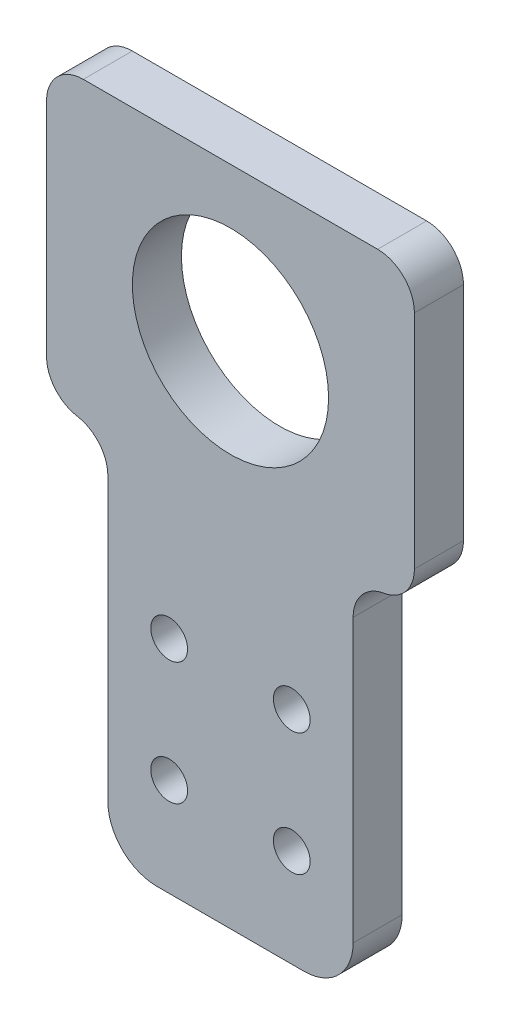
ISO-10303-21;
HEADER;
FILE_DESCRIPTION(('STEP AP214'),'2;1');
FILE_NAME('part.step','',(''),(''),'','','');
FILE_SCHEMA(('AUTOMOTIVE_DESIGN { 1 0 10303 214 1 1 1 1 }'));
ENDSEC;
DATA;
#1=APPLICATION_CONTEXT('core data for automotive mechanical design processes');
#2=APPLICATION_PROTOCOL_DEFINITION('international standard','automotive_design',2000,#1);
#3=PRODUCT_CONTEXT('',#1,'mechanical');
#4=PRODUCT('Part','Part','',(#3));
#5=PRODUCT_RELATED_PRODUCT_CATEGORY('part','',(#4));
#6=PRODUCT_DEFINITION_FORMATION('','',#4);
#7=PRODUCT_DEFINITION_CONTEXT('part definition',#1,'design');
#8=PRODUCT_DEFINITION('design','',#6,#7);
#9=PRODUCT_DEFINITION_SHAPE('','',#8);
#10=(LENGTH_UNIT() NAMED_UNIT(*) SI_UNIT(.MILLI.,.METRE.));
#11=(NAMED_UNIT(*) PLANE_ANGLE_UNIT() SI_UNIT($,.RADIAN.));
#12=(NAMED_UNIT(*) SI_UNIT($,.STERADIAN.) SOLID_ANGLE_UNIT());
#13=UNCERTAINTY_MEASURE_WITH_UNIT(LENGTH_MEASURE(1.E-05),#10,'distance_accuracy_value','');
#14=(GEOMETRIC_REPRESENTATION_CONTEXT(3) GLOBAL_UNCERTAINTY_ASSIGNED_CONTEXT((#13)) GLOBAL_UNIT_ASSIGNED_CONTEXT((#10,
#11,#12)) REPRESENTATION_CONTEXT('',''));
#15=CARTESIAN_POINT('',(0.,0.,0.));
#16=DIRECTION('',(0.,0.,1.));
#17=DIRECTION('',(1.,0.,0.));
#18=AXIS2_PLACEMENT_3D('',#15,#16,#17);
#19=CARTESIAN_POINT('',(6.,-11.,4.));
#20=DIRECTION('',(0.,0.,1.));
#21=DIRECTION('',(1.,0.,0.));
#22=AXIS2_PLACEMENT_3D('',#19,#20,#21);
#23=CYLINDRICAL_SURFACE('',#22,4.);
#24=DIRECTION('',(0.,0.,1.));
#25=VECTOR('',#24,1.);
#26=CARTESIAN_POINT('',(6.,-15.,4.));
#27=LINE('',#26,#25);
#28=CARTESIAN_POINT('',(6.,-15.,0.));
#29=VERTEX_POINT('',#28);
#30=CARTESIAN_POINT('',(6.,-15.,4.));
#31=VERTEX_POINT('',#30);
#32=EDGE_CURVE('E221',#29,#31,#27,.T.);
#33=ORIENTED_EDGE('',*,*,#32,.F.);
#34=CARTESIAN_POINT('',(6.,-11.,0.));
#35=DIRECTION('',(0.,0.,-1.));
#36=DIRECTION('',(-1.,0.,0.));
#37=AXIS2_PLACEMENT_3D('',#34,#35,#36);
#38=CIRCLE('',#37,4.);
#39=CARTESIAN_POINT('',(10.,-11.,0.));
#40=VERTEX_POINT('',#39);
#41=EDGE_CURVE('E40',#40,#29,#38,.T.);
#42=ORIENTED_EDGE('',*,*,#41,.F.);
#43=DIRECTION('',(0.,0.,1.));
#44=VECTOR('',#43,1.);
#45=CARTESIAN_POINT('',(10.,-11.,4.));
#46=LINE('',#45,#44);
#47=CARTESIAN_POINT('',(10.,-11.,4.));
#48=VERTEX_POINT('',#47);
#49=EDGE_CURVE('E137',#48,#40,#46,.F.);
#50=ORIENTED_EDGE('',*,*,#49,.F.);
#51=CARTESIAN_POINT('',(6.,-11.,4.));
#52=DIRECTION('',(0.,0.,-1.));
#53=DIRECTION('',(-1.,0.,0.));
#54=AXIS2_PLACEMENT_3D('',#51,#52,#53);
#55=CIRCLE('',#54,4.);
#56=EDGE_CURVE('E11',#31,#48,#55,.F.);
#57=ORIENTED_EDGE('',*,*,#56,.F.);
#58=EDGE_LOOP('',(#33,#42,#50,#57));
#59=FACE_BOUND('',#58,.T.);
#60=ADVANCED_FACE('F33',(#59),#23,.T.);
#61=CARTESIAN_POINT('',(-6.,-11.,4.));
#62=DIRECTION('',(0.,0.,1.));
#63=DIRECTION('',(1.,0.,0.));
#64=AXIS2_PLACEMENT_3D('',#61,#62,#63);
#65=CYLINDRICAL_SURFACE('',#64,4.);
#66=DIRECTION('',(0.,0.,1.));
#67=VECTOR('',#66,1.);
#68=CARTESIAN_POINT('',(-10.,-11.,4.));
#69=LINE('',#68,#67);
#70=CARTESIAN_POINT('',(-10.,-11.,0.));
#71=VERTEX_POINT('',#70);
#72=CARTESIAN_POINT('',(-10.,-11.,4.));
#73=VERTEX_POINT('',#72);
#74=EDGE_CURVE('E211',#71,#73,#69,.T.);
#75=ORIENTED_EDGE('',*,*,#74,.F.);
#76=CARTESIAN_POINT('',(-6.,-11.,0.));
#77=DIRECTION('',(0.,0.,-1.));
#78=DIRECTION('',(-1.,0.,0.));
#79=AXIS2_PLACEMENT_3D('',#76,#77,#78);
#80=CIRCLE('',#79,4.);
#81=CARTESIAN_POINT('',(-6.,-15.,0.));
#82=VERTEX_POINT('',#81);
#83=EDGE_CURVE('E217',#82,#71,#80,.T.);
#84=ORIENTED_EDGE('',*,*,#83,.F.);
#85=DIRECTION('',(0.,0.,1.));
#86=VECTOR('',#85,1.);
#87=CARTESIAN_POINT('',(-6.,-15.,4.));
#88=LINE('',#87,#86);
#89=CARTESIAN_POINT('',(-6.,-15.,4.));
#90=VERTEX_POINT('',#89);
#91=EDGE_CURVE('E214',#90,#82,#88,.F.);
#92=ORIENTED_EDGE('',*,*,#91,.F.);
#93=CARTESIAN_POINT('',(-6.,-11.,4.));
#94=DIRECTION('',(0.,0.,-1.));
#95=DIRECTION('',(-1.,0.,0.));
#96=AXIS2_PLACEMENT_3D('',#93,#94,#95);
#97=CIRCLE('',#96,4.);
#98=EDGE_CURVE('E219',#73,#90,#97,.F.);
#99=ORIENTED_EDGE('',*,*,#98,.F.);
#100=EDGE_LOOP('',(#75,#84,#92,#99));
#101=FACE_BOUND('',#100,.T.);
#102=ADVANCED_FACE('F284',(#101),#65,.T.);
#103=CARTESIAN_POINT('',(0.,0.,4.));
#104=DIRECTION('',(0.,0.,-1.));
#105=DIRECTION('',(-1.,0.,0.));
#106=AXIS2_PLACEMENT_3D('',#103,#104,#105);
#107=PLANE('',#106);
#108=CARTESIAN_POINT('',(0.,26.5,4.));
#109=DIRECTION('',(0.,0.,1.));
#110=DIRECTION('',(1.,0.,0.));
#111=AXIS2_PLACEMENT_3D('',#108,#109,#110);
#112=CIRCLE('',#111,8.);
#113=CARTESIAN_POINT('',(8.,26.5,4.));
#114=VERTEX_POINT('',#113);
#115=EDGE_CURVE('E176',#114,#114,#112,.T.);
#116=ORIENTED_EDGE('',*,*,#115,.F.);
#117=EDGE_LOOP('',(#116));
#118=FACE_BOUND('',#117,.T.);
#119=DIRECTION('',(1.,0.,0.));
#120=VECTOR('',#119,1.);
#121=CARTESIAN_POINT('',(-10.,-15.,4.));
#122=LINE('',#121,#120);
#123=EDGE_CURVE('E155',#90,#31,#122,.T.);
#124=ORIENTED_EDGE('',*,*,#123,.T.);
#125=ORIENTED_EDGE('',*,*,#56,.T.);
#126=DIRECTION('',(0.,1.,0.));
#127=VECTOR('',#126,1.);
#128=CARTESIAN_POINT('',(10.,-15.,4.));
#129=LINE('',#128,#127);
#130=CARTESIAN_POINT('',(10.,12.,4.));
#131=VERTEX_POINT('',#130);
#132=EDGE_CURVE('E230',#48,#131,#129,.T.);
#133=ORIENTED_EDGE('',*,*,#132,.T.);
#134=CARTESIAN_POINT('',(13.,12.,4.));
#135=DIRECTION('',(0.,0.,-1.));
#136=DIRECTION('',(-1.,0.,0.));
#137=AXIS2_PLACEMENT_3D('',#134,#135,#136);
#138=CIRCLE('',#137,3.);
#139=CARTESIAN_POINT('',(12.5,14.9580398915498,4.));
#140=VERTEX_POINT('',#139);
#141=EDGE_CURVE('E150',#131,#140,#138,.T.);
#142=ORIENTED_EDGE('',*,*,#141,.T.);
#143=CARTESIAN_POINT('',(12.,17.9160797830996,4.));
#144=DIRECTION('',(0.,0.,-1.));
#145=DIRECTION('',(-1.,0.,0.));
#146=AXIS2_PLACEMENT_3D('',#143,#144,#145);
#147=CIRCLE('',#146,3.);
#148=CARTESIAN_POINT('',(15.,17.9160797830996,4.));
#149=VERTEX_POINT('',#148);
#150=EDGE_CURVE('E196',#140,#149,#147,.F.);
#151=ORIENTED_EDGE('',*,*,#150,.T.);
#152=DIRECTION('',(0.,-1.,0.));
#153=VECTOR('',#152,1.);
#154=CARTESIAN_POINT('',(15.,39.,4.));
#155=LINE('',#154,#153);
#156=CARTESIAN_POINT('',(15.,36.,4.));
#157=VERTEX_POINT('',#156);
#158=EDGE_CURVE('E269',#157,#149,#155,.T.);
#159=ORIENTED_EDGE('',*,*,#158,.F.);
#160=CARTESIAN_POINT('',(12.,36.,4.));
#161=DIRECTION('',(0.,0.,-1.));
#162=DIRECTION('',(-1.,0.,0.));
#163=AXIS2_PLACEMENT_3D('',#160,#161,#162);
#164=CIRCLE('',#163,3.);
#165=CARTESIAN_POINT('',(12.,39.,4.));
#166=VERTEX_POINT('',#165);
#167=EDGE_CURVE('E194',#157,#166,#164,.F.);
#168=ORIENTED_EDGE('',*,*,#167,.T.);
#169=DIRECTION('',(1.,0.,0.));
#170=VECTOR('',#169,1.);
#171=CARTESIAN_POINT('',(-15.,39.,4.));
#172=LINE('',#171,#170);
#173=CARTESIAN_POINT('',(-12.,39.,4.));
#174=VERTEX_POINT('',#173);
#175=EDGE_CURVE('E272',#174,#166,#172,.T.);
#176=ORIENTED_EDGE('',*,*,#175,.F.);
#177=CARTESIAN_POINT('',(-12.,36.,4.));
#178=DIRECTION('',(0.,0.,-1.));
#179=DIRECTION('',(-1.,0.,0.));
#180=AXIS2_PLACEMENT_3D('',#177,#178,#179);
#181=CIRCLE('',#180,3.);
#182=CARTESIAN_POINT('',(-15.,36.,4.));
#183=VERTEX_POINT('',#182);
#184=EDGE_CURVE('E192',#174,#183,#181,.F.);
#185=ORIENTED_EDGE('',*,*,#184,.T.);
#186=DIRECTION('',(0.,-1.,0.));
#187=VECTOR('',#186,1.);
#188=CARTESIAN_POINT('',(-15.,39.,4.));
#189=LINE('',#188,#187);
#190=CARTESIAN_POINT('',(-15.,17.9160797830996,4.));
#191=VERTEX_POINT('',#190);
#192=EDGE_CURVE('E266',#183,#191,#189,.T.);
#193=ORIENTED_EDGE('',*,*,#192,.T.);
#194=CARTESIAN_POINT('',(-12.,17.9160797830996,4.));
#195=DIRECTION('',(0.,0.,-1.));
#196=DIRECTION('',(-1.,0.,0.));
#197=AXIS2_PLACEMENT_3D('',#194,#195,#196);
#198=CIRCLE('',#197,3.);
#199=CARTESIAN_POINT('',(-12.5,14.9580398915498,4.));
#200=VERTEX_POINT('',#199);
#201=EDGE_CURVE('E190',#191,#200,#198,.F.);
#202=ORIENTED_EDGE('',*,*,#201,.T.);
#203=CARTESIAN_POINT('',(-13.,12.,4.));
#204=DIRECTION('',(0.,0.,-1.));
#205=DIRECTION('',(-1.,0.,0.));
#206=AXIS2_PLACEMENT_3D('',#203,#204,#205);
#207=CIRCLE('',#206,3.);
#208=CARTESIAN_POINT('',(-10.,12.,4.));
#209=VERTEX_POINT('',#208);
#210=EDGE_CURVE('E169',#200,#209,#207,.T.);
#211=ORIENTED_EDGE('',*,*,#210,.T.);
#212=DIRECTION('',(0.,-1.,0.));
#213=VECTOR('',#212,1.);
#214=CARTESIAN_POINT('',(-10.,-15.,4.));
#215=LINE('',#214,#213);
#216=EDGE_CURVE('E159',#209,#73,#215,.T.);
#217=ORIENTED_EDGE('',*,*,#216,.T.);
#218=ORIENTED_EDGE('',*,*,#98,.T.);
#219=EDGE_LOOP('',(#124,#125,#133,#142,#151,#159,#168,#176,#185,#193,#202,#211,#217,#218));
#220=FACE_BOUND('',#219,.T.);
#221=CARTESIAN_POINT('',(-5.,3.,4.));
#222=DIRECTION('',(0.,0.,1.));
#223=DIRECTION('',(1.,0.,0.));
#224=AXIS2_PLACEMENT_3D('',#221,#222,#223);
#225=CIRCLE('',#224,1.5);
#226=CARTESIAN_POINT('',(-3.5,3.,4.));
#227=VERTEX_POINT('',#226);
#228=EDGE_CURVE('E140',#227,#227,#225,.T.);
#229=ORIENTED_EDGE('',*,*,#228,.F.);
#230=EDGE_LOOP('',(#229));
#231=FACE_BOUND('',#230,.T.);
#232=CARTESIAN_POINT('',(5.,3.,4.));
#233=DIRECTION('',(0.,0.,1.));
#234=DIRECTION('',(1.,0.,0.));
#235=AXIS2_PLACEMENT_3D('',#232,#233,#234);
#236=CIRCLE('',#235,1.5);
#237=CARTESIAN_POINT('',(6.5,3.,4.));
#238=VERTEX_POINT('',#237);
#239=EDGE_CURVE('E241',#238,#238,#236,.T.);
#240=ORIENTED_EDGE('',*,*,#239,.F.);
#241=EDGE_LOOP('',(#240));
#242=FACE_BOUND('',#241,.T.);
#243=CARTESIAN_POINT('',(-5.,-7.,4.));
#244=DIRECTION('',(0.,0.,1.));
#245=DIRECTION('',(1.,0.,0.));
#246=AXIS2_PLACEMENT_3D('',#243,#244,#245);
#247=CIRCLE('',#246,1.5);
#248=CARTESIAN_POINT('',(-3.5,-7.,4.));
#249=VERTEX_POINT('',#248);
#250=EDGE_CURVE('E247',#249,#249,#247,.T.);
#251=ORIENTED_EDGE('',*,*,#250,.F.);
#252=EDGE_LOOP('',(#251));
#253=FACE_BOUND('',#252,.T.);
#254=CARTESIAN_POINT('',(5.,-7.,4.));
#255=DIRECTION('',(0.,0.,1.));
#256=DIRECTION('',(1.,0.,0.));
#257=AXIS2_PLACEMENT_3D('',#254,#255,#256);
#258=CIRCLE('',#257,1.5);
#259=CARTESIAN_POINT('',(6.5,-7.,4.));
#260=VERTEX_POINT('',#259);
#261=EDGE_CURVE('E253',#260,#260,#258,.T.);
#262=ORIENTED_EDGE('',*,*,#261,.F.);
#263=EDGE_LOOP('',(#262));
#264=FACE_BOUND('',#263,.T.);
#265=ADVANCED_FACE('F282',(#118,#220,#231,#242,#253,#264),#107,.F.);
#266=CARTESIAN_POINT('',(0.,0.,0.));
#267=DIRECTION('',(0.,0.,-1.));
#268=DIRECTION('',(-1.,0.,0.));
#269=AXIS2_PLACEMENT_3D('',#266,#267,#268);
#270=PLANE('',#269);
#271=CARTESIAN_POINT('',(0.,26.5,0.));
#272=DIRECTION('',(0.,0.,-1.));
#273=DIRECTION('',(-1.,0.,0.));
#274=AXIS2_PLACEMENT_3D('',#271,#272,#273);
#275=CIRCLE('',#274,8.);
#276=CARTESIAN_POINT('',(-8.,26.5,0.));
#277=VERTEX_POINT('',#276);
#278=EDGE_CURVE('E172',#277,#277,#275,.T.);
#279=ORIENTED_EDGE('',*,*,#278,.F.);
#280=EDGE_LOOP('',(#279));
#281=FACE_BOUND('',#280,.T.);
#282=CARTESIAN_POINT('',(-5.,-7.,0.));
#283=DIRECTION('',(0.,0.,1.));
#284=DIRECTION('',(1.,0.,0.));
#285=AXIS2_PLACEMENT_3D('',#282,#283,#284);
#286=CIRCLE('',#285,1.5);
#287=CARTESIAN_POINT('',(-3.5,-7.,0.));
#288=VERTEX_POINT('',#287);
#289=EDGE_CURVE('E250',#288,#288,#286,.T.);
#290=ORIENTED_EDGE('',*,*,#289,.T.);
#291=EDGE_LOOP('',(#290));
#292=FACE_BOUND('',#291,.T.);
#293=CARTESIAN_POINT('',(-5.,3.,0.));
#294=DIRECTION('',(0.,0.,1.));
#295=DIRECTION('',(1.,0.,0.));
#296=AXIS2_PLACEMENT_3D('',#293,#294,#295);
#297=CIRCLE('',#296,1.5);
#298=CARTESIAN_POINT('',(-3.5,3.,0.));
#299=VERTEX_POINT('',#298);
#300=EDGE_CURVE('E238',#299,#299,#297,.T.);
#301=ORIENTED_EDGE('',*,*,#300,.T.);
#302=EDGE_LOOP('',(#301));
#303=FACE_BOUND('',#302,.T.);
#304=DIRECTION('',(0.,1.,0.));
#305=VECTOR('',#304,1.);
#306=CARTESIAN_POINT('',(10.,-15.,0.));
#307=LINE('',#306,#305);
#308=CARTESIAN_POINT('',(10.,12.,0.));
#309=VERTEX_POINT('',#308);
#310=EDGE_CURVE('E130',#40,#309,#307,.T.);
#311=ORIENTED_EDGE('',*,*,#310,.F.);
#312=ORIENTED_EDGE('',*,*,#41,.T.);
#313=DIRECTION('',(1.,0.,0.));
#314=VECTOR('',#313,1.);
#315=CARTESIAN_POINT('',(-10.,-15.,0.));
#316=LINE('',#315,#314);
#317=EDGE_CURVE('E162',#82,#29,#316,.T.);
#318=ORIENTED_EDGE('',*,*,#317,.F.);
#319=ORIENTED_EDGE('',*,*,#83,.T.);
#320=DIRECTION('',(0.,-1.,0.));
#321=VECTOR('',#320,1.);
#322=CARTESIAN_POINT('',(-10.,-15.,0.));
#323=LINE('',#322,#321);
#324=CARTESIAN_POINT('',(-10.,12.,0.));
#325=VERTEX_POINT('',#324);
#326=EDGE_CURVE('E139',#325,#71,#323,.T.);
#327=ORIENTED_EDGE('',*,*,#326,.F.);
#328=CARTESIAN_POINT('',(-13.,12.,0.));
#329=DIRECTION('',(0.,0.,-1.));
#330=DIRECTION('',(-1.,0.,0.));
#331=AXIS2_PLACEMENT_3D('',#328,#329,#330);
#332=CIRCLE('',#331,3.);
#333=CARTESIAN_POINT('',(-12.5,14.9580398915498,0.));
#334=VERTEX_POINT('',#333);
#335=EDGE_CURVE('E166',#325,#334,#332,.F.);
#336=ORIENTED_EDGE('',*,*,#335,.T.);
#337=CARTESIAN_POINT('',(-12.,17.9160797830996,0.));
#338=DIRECTION('',(0.,0.,-1.));
#339=DIRECTION('',(-1.,0.,0.));
#340=AXIS2_PLACEMENT_3D('',#337,#338,#339);
#341=CIRCLE('',#340,3.);
#342=CARTESIAN_POINT('',(-15.,17.9160797830996,0.));
#343=VERTEX_POINT('',#342);
#344=EDGE_CURVE('E181',#334,#343,#341,.T.);
#345=ORIENTED_EDGE('',*,*,#344,.T.);
#346=DIRECTION('',(0.,-1.,0.));
#347=VECTOR('',#346,1.);
#348=CARTESIAN_POINT('',(-15.,39.,0.));
#349=LINE('',#348,#347);
#350=CARTESIAN_POINT('',(-15.,36.,0.));
#351=VERTEX_POINT('',#350);
#352=EDGE_CURVE('E263',#351,#343,#349,.T.);
#353=ORIENTED_EDGE('',*,*,#352,.F.);
#354=CARTESIAN_POINT('',(-12.,36.,0.));
#355=DIRECTION('',(0.,0.,-1.));
#356=DIRECTION('',(-1.,0.,0.));
#357=AXIS2_PLACEMENT_3D('',#354,#355,#356);
#358=CIRCLE('',#357,3.);
#359=CARTESIAN_POINT('',(-12.,39.,0.));
#360=VERTEX_POINT('',#359);
#361=EDGE_CURVE('E183',#351,#360,#358,.T.);
#362=ORIENTED_EDGE('',*,*,#361,.T.);
#363=DIRECTION('',(-1.,0.,0.));
#364=VECTOR('',#363,1.);
#365=CARTESIAN_POINT('',(-15.,39.,0.));
#366=LINE('',#365,#364);
#367=CARTESIAN_POINT('',(12.,39.,0.));
#368=VERTEX_POINT('',#367);
#369=EDGE_CURVE('E175',#368,#360,#366,.T.);
#370=ORIENTED_EDGE('',*,*,#369,.F.);
#371=CARTESIAN_POINT('',(12.,36.,0.));
#372=DIRECTION('',(0.,0.,-1.));
#373=DIRECTION('',(-1.,0.,0.));
#374=AXIS2_PLACEMENT_3D('',#371,#372,#373);
#375=CIRCLE('',#374,3.);
#376=CARTESIAN_POINT('',(15.,36.,0.));
#377=VERTEX_POINT('',#376);
#378=EDGE_CURVE('E185',#368,#377,#375,.T.);
#379=ORIENTED_EDGE('',*,*,#378,.T.);
#380=DIRECTION('',(0.,-1.,0.));
#381=VECTOR('',#380,1.);
#382=CARTESIAN_POINT('',(15.,39.,0.));
#383=LINE('',#382,#381);
#384=CARTESIAN_POINT('',(15.,17.9160797830996,0.));
#385=VERTEX_POINT('',#384);
#386=EDGE_CURVE('E259',#377,#385,#383,.T.);
#387=ORIENTED_EDGE('',*,*,#386,.T.);
#388=CARTESIAN_POINT('',(12.,17.9160797830996,0.));
#389=DIRECTION('',(0.,0.,-1.));
#390=DIRECTION('',(-1.,0.,0.));
#391=AXIS2_PLACEMENT_3D('',#388,#389,#390);
#392=CIRCLE('',#391,3.);
#393=CARTESIAN_POINT('',(12.5,14.9580398915498,0.));
#394=VERTEX_POINT('',#393);
#395=EDGE_CURVE('E147',#385,#394,#392,.T.);
#396=ORIENTED_EDGE('',*,*,#395,.T.);
#397=CARTESIAN_POINT('',(13.,12.,0.));
#398=DIRECTION('',(0.,0.,-1.));
#399=DIRECTION('',(-1.,0.,0.));
#400=AXIS2_PLACEMENT_3D('',#397,#398,#399);
#401=CIRCLE('',#400,3.);
#402=EDGE_CURVE('E143',#394,#309,#401,.F.);
#403=ORIENTED_EDGE('',*,*,#402,.T.);
#404=EDGE_LOOP('',(#311,#312,#318,#319,#327,#336,#345,#353,#362,#370,#379,#387,#396,#403));
#405=FACE_BOUND('',#404,.T.);
#406=CARTESIAN_POINT('',(5.,3.,0.));
#407=DIRECTION('',(0.,0.,1.));
#408=DIRECTION('',(1.,0.,0.));
#409=AXIS2_PLACEMENT_3D('',#406,#407,#408);
#410=CIRCLE('',#409,1.5);
#411=CARTESIAN_POINT('',(6.5,3.,0.));
#412=VERTEX_POINT('',#411);
#413=EDGE_CURVE('E244',#412,#412,#410,.T.);
#414=ORIENTED_EDGE('',*,*,#413,.T.);
#415=EDGE_LOOP('',(#414));
#416=FACE_BOUND('',#415,.T.);
#417=CARTESIAN_POINT('',(5.,-7.,0.));
#418=DIRECTION('',(0.,0.,1.));
#419=DIRECTION('',(1.,0.,0.));
#420=AXIS2_PLACEMENT_3D('',#417,#418,#419);
#421=CIRCLE('',#420,1.5);
#422=CARTESIAN_POINT('',(6.5,-7.,0.));
#423=VERTEX_POINT('',#422);
#424=EDGE_CURVE('E256',#423,#423,#421,.T.);
#425=ORIENTED_EDGE('',*,*,#424,.T.);
#426=EDGE_LOOP('',(#425));
#427=FACE_BOUND('',#426,.T.);
#428=ADVANCED_FACE('F144',(#281,#292,#303,#405,#416,#427),#270,.T.);
#429=CARTESIAN_POINT('',(10.,-15.,4.));
#430=DIRECTION('',(-1.,0.,0.));
#431=DIRECTION('',(0.,0.,1.));
#432=AXIS2_PLACEMENT_3D('',#429,#430,#431);
#433=PLANE('',#432);
#434=ORIENTED_EDGE('',*,*,#132,.F.);
#435=ORIENTED_EDGE('',*,*,#49,.T.);
#436=ORIENTED_EDGE('',*,*,#310,.T.);
#437=DIRECTION('',(0.,0.,-1.));
#438=VECTOR('',#437,1.);
#439=CARTESIAN_POINT('',(10.,12.,4.));
#440=LINE('',#439,#438);
#441=EDGE_CURVE('E135',#309,#131,#440,.F.);
#442=ORIENTED_EDGE('',*,*,#441,.T.);
#443=EDGE_LOOP('',(#434,#435,#436,#442));
#444=FACE_BOUND('',#443,.T.);
#445=ADVANCED_FACE('F133',(#444),#433,.F.);
#446=CARTESIAN_POINT('',(-10.,-15.,4.));
#447=DIRECTION('',(1.,0.,0.));
#448=DIRECTION('',(0.,0.,-1.));
#449=AXIS2_PLACEMENT_3D('',#446,#447,#448);
#450=PLANE('',#449);
#451=ORIENTED_EDGE('',*,*,#326,.T.);
#452=ORIENTED_EDGE('',*,*,#74,.T.);
#453=ORIENTED_EDGE('',*,*,#216,.F.);
#454=DIRECTION('',(0.,0.,-1.));
#455=VECTOR('',#454,1.);
#456=CARTESIAN_POINT('',(-10.,12.,0.));
#457=LINE('',#456,#455);
#458=EDGE_CURVE('E151',#209,#325,#457,.T.);
#459=ORIENTED_EDGE('',*,*,#458,.T.);
#460=EDGE_LOOP('',(#451,#452,#453,#459));
#461=FACE_BOUND('',#460,.T.);
#462=ADVANCED_FACE('F309',(#461),#450,.F.);
#463=CARTESIAN_POINT('',(-10.,-15.,4.));
#464=DIRECTION('',(0.,1.,0.));
#465=DIRECTION('',(0.,0.,1.));
#466=AXIS2_PLACEMENT_3D('',#463,#464,#465);
#467=PLANE('',#466);
#468=ORIENTED_EDGE('',*,*,#317,.T.);
#469=ORIENTED_EDGE('',*,*,#32,.T.);
#470=ORIENTED_EDGE('',*,*,#123,.F.);
#471=ORIENTED_EDGE('',*,*,#91,.T.);
#472=EDGE_LOOP('',(#468,#469,#470,#471));
#473=FACE_BOUND('',#472,.T.);
#474=ADVANCED_FACE('F228',(#473),#467,.F.);
#475=CARTESIAN_POINT('',(-5.,3.,4.));
#476=DIRECTION('',(0.,0.,-1.));
#477=DIRECTION('',(-1.,0.,0.));
#478=AXIS2_PLACEMENT_3D('',#475,#476,#477);
#479=CYLINDRICAL_SURFACE('',#478,1.5);
#480=ORIENTED_EDGE('',*,*,#228,.T.);
#481=EDGE_LOOP('',(#480));
#482=FACE_BOUND('',#481,.T.);
#483=ORIENTED_EDGE('',*,*,#300,.F.);
#484=EDGE_LOOP('',(#483));
#485=FACE_BOUND('',#484,.T.);
#486=ADVANCED_FACE('F348',(#482,#485),#479,.F.);
#487=CARTESIAN_POINT('',(5.,3.,4.));
#488=DIRECTION('',(0.,0.,-1.));
#489=DIRECTION('',(-1.,0.,0.));
#490=AXIS2_PLACEMENT_3D('',#487,#488,#489);
#491=CYLINDRICAL_SURFACE('',#490,1.5);
#492=ORIENTED_EDGE('',*,*,#239,.T.);
#493=EDGE_LOOP('',(#492));
#494=FACE_BOUND('',#493,.T.);
#495=ORIENTED_EDGE('',*,*,#413,.F.);
#496=EDGE_LOOP('',(#495));
#497=FACE_BOUND('',#496,.T.);
#498=ADVANCED_FACE('F352',(#494,#497),#491,.F.);
#499=CARTESIAN_POINT('',(-5.,-7.,4.));
#500=DIRECTION('',(0.,0.,-1.));
#501=DIRECTION('',(-1.,0.,0.));
#502=AXIS2_PLACEMENT_3D('',#499,#500,#501);
#503=CYLINDRICAL_SURFACE('',#502,1.5);
#504=ORIENTED_EDGE('',*,*,#250,.T.);
#505=EDGE_LOOP('',(#504));
#506=FACE_BOUND('',#505,.T.);
#507=ORIENTED_EDGE('',*,*,#289,.F.);
#508=EDGE_LOOP('',(#507));
#509=FACE_BOUND('',#508,.T.);
#510=ADVANCED_FACE('F299',(#506,#509),#503,.F.);
#511=CARTESIAN_POINT('',(5.,-7.,4.));
#512=DIRECTION('',(0.,0.,-1.));
#513=DIRECTION('',(-1.,0.,0.));
#514=AXIS2_PLACEMENT_3D('',#511,#512,#513);
#515=CYLINDRICAL_SURFACE('',#514,1.5);
#516=ORIENTED_EDGE('',*,*,#261,.T.);
#517=EDGE_LOOP('',(#516));
#518=FACE_BOUND('',#517,.T.);
#519=ORIENTED_EDGE('',*,*,#424,.F.);
#520=EDGE_LOOP('',(#519));
#521=FACE_BOUND('',#520,.T.);
#522=ADVANCED_FACE('F295',(#518,#521),#515,.F.);
#523=CARTESIAN_POINT('',(15.,39.,0.));
#524=DIRECTION('',(-1.,0.,0.));
#525=DIRECTION('',(0.,0.,1.));
#526=AXIS2_PLACEMENT_3D('',#523,#524,#525);
#527=PLANE('',#526);
#528=ORIENTED_EDGE('',*,*,#158,.T.);
#529=DIRECTION('',(0.,0.,1.));
#530=VECTOR('',#529,1.);
#531=CARTESIAN_POINT('',(15.,17.9160797830996,0.));
#532=LINE('',#531,#530);
#533=EDGE_CURVE('E178',#149,#385,#532,.F.);
#534=ORIENTED_EDGE('',*,*,#533,.T.);
#535=ORIENTED_EDGE('',*,*,#386,.F.);
#536=DIRECTION('',(0.,0.,-1.));
#537=VECTOR('',#536,1.);
#538=CARTESIAN_POINT('',(15.,36.,4.));
#539=LINE('',#538,#537);
#540=EDGE_CURVE('E171',#377,#157,#539,.F.);
#541=ORIENTED_EDGE('',*,*,#540,.T.);
#542=EDGE_LOOP('',(#528,#534,#535,#541));
#543=FACE_BOUND('',#542,.T.);
#544=ADVANCED_FACE('F298',(#543),#527,.F.);
#545=CARTESIAN_POINT('',(-15.,39.,0.));
#546=DIRECTION('',(1.,0.,0.));
#547=DIRECTION('',(0.,0.,-1.));
#548=AXIS2_PLACEMENT_3D('',#545,#546,#547);
#549=PLANE('',#548);
#550=ORIENTED_EDGE('',*,*,#192,.F.);
#551=DIRECTION('',(0.,0.,1.));
#552=VECTOR('',#551,1.);
#553=CARTESIAN_POINT('',(-15.,36.,0.));
#554=LINE('',#553,#552);
#555=EDGE_CURVE('E207',#183,#351,#554,.F.);
#556=ORIENTED_EDGE('',*,*,#555,.T.);
#557=ORIENTED_EDGE('',*,*,#352,.T.);
#558=DIRECTION('',(0.,0.,1.));
#559=VECTOR('',#558,1.);
#560=CARTESIAN_POINT('',(-15.,17.9160797830996,0.));
#561=LINE('',#560,#559);
#562=EDGE_CURVE('E204',#343,#191,#561,.T.);
#563=ORIENTED_EDGE('',*,*,#562,.T.);
#564=EDGE_LOOP('',(#550,#556,#557,#563));
#565=FACE_BOUND('',#564,.T.);
#566=ADVANCED_FACE('F367',(#565),#549,.F.);
#567=CARTESIAN_POINT('',(0.,39.,0.));
#568=DIRECTION('',(0.,1.,0.));
#569=DIRECTION('',(0.,0.,1.));
#570=AXIS2_PLACEMENT_3D('',#567,#568,#569);
#571=PLANE('',#570);
#572=ORIENTED_EDGE('',*,*,#175,.T.);
#573=DIRECTION('',(0.,0.,-1.));
#574=VECTOR('',#573,1.);
#575=CARTESIAN_POINT('',(12.,39.,0.));
#576=LINE('',#575,#574);
#577=EDGE_CURVE('E201',#166,#368,#576,.T.);
#578=ORIENTED_EDGE('',*,*,#577,.T.);
#579=ORIENTED_EDGE('',*,*,#369,.T.);
#580=DIRECTION('',(0.,0.,1.));
#581=VECTOR('',#580,1.);
#582=CARTESIAN_POINT('',(-12.,39.,4.));
#583=LINE('',#582,#581);
#584=EDGE_CURVE('E198',#360,#174,#583,.T.);
#585=ORIENTED_EDGE('',*,*,#584,.T.);
#586=EDGE_LOOP('',(#572,#578,#579,#585));
#587=FACE_BOUND('',#586,.T.);
#588=ADVANCED_FACE('F344',(#587),#571,.T.);
#589=CARTESIAN_POINT('',(13.,12.,0.));
#590=DIRECTION('',(0.,0.,1.));
#591=DIRECTION('',(1.,0.,0.));
#592=AXIS2_PLACEMENT_3D('',#589,#590,#591);
#593=CYLINDRICAL_SURFACE('',#592,3.);
#594=ORIENTED_EDGE('',*,*,#402,.F.);
#595=DIRECTION('',(0.,0.,1.));
#596=VECTOR('',#595,1.);
#597=CARTESIAN_POINT('',(12.5,14.9580398915498,0.));
#598=LINE('',#597,#596);
#599=EDGE_CURVE('E188',#394,#140,#598,.T.);
#600=ORIENTED_EDGE('',*,*,#599,.T.);
#601=ORIENTED_EDGE('',*,*,#141,.F.);
#602=ORIENTED_EDGE('',*,*,#441,.F.);
#603=EDGE_LOOP('',(#594,#600,#601,#602));
#604=FACE_BOUND('',#603,.T.);
#605=ADVANCED_FACE('F153',(#604),#593,.F.);
#606=CARTESIAN_POINT('',(-13.,12.,4.));
#607=DIRECTION('',(0.,0.,1.));
#608=DIRECTION('',(1.,0.,0.));
#609=AXIS2_PLACEMENT_3D('',#606,#607,#608);
#610=CYLINDRICAL_SURFACE('',#609,3.);
#611=ORIENTED_EDGE('',*,*,#210,.F.);
#612=DIRECTION('',(0.,0.,1.));
#613=VECTOR('',#612,1.);
#614=CARTESIAN_POINT('',(-12.5,14.9580398915498,4.));
#615=LINE('',#614,#613);
#616=EDGE_CURVE('E209',#200,#334,#615,.F.);
#617=ORIENTED_EDGE('',*,*,#616,.T.);
#618=ORIENTED_EDGE('',*,*,#335,.F.);
#619=ORIENTED_EDGE('',*,*,#458,.F.);
#620=EDGE_LOOP('',(#611,#617,#618,#619));
#621=FACE_BOUND('',#620,.T.);
#622=ADVANCED_FACE('F339',(#621),#610,.F.);
#623=CARTESIAN_POINT('',(0.,26.5,-20.));
#624=DIRECTION('',(0.,0.,1.));
#625=DIRECTION('',(1.,0.,0.));
#626=AXIS2_PLACEMENT_3D('',#623,#624,#625);
#627=CYLINDRICAL_SURFACE('',#626,8.);
#628=ORIENTED_EDGE('',*,*,#278,.T.);
#629=EDGE_LOOP('',(#628));
#630=FACE_BOUND('',#629,.T.);
#631=ORIENTED_EDGE('',*,*,#115,.T.);
#632=EDGE_LOOP('',(#631));
#633=FACE_BOUND('',#632,.T.);
#634=ADVANCED_FACE('F280',(#630,#633),#627,.F.);
#635=CARTESIAN_POINT('',(12.,17.9160797830996,0.));
#636=DIRECTION('',(0.,0.,1.));
#637=DIRECTION('',(1.,0.,0.));
#638=AXIS2_PLACEMENT_3D('',#635,#636,#637);
#639=CYLINDRICAL_SURFACE('',#638,3.);
#640=ORIENTED_EDGE('',*,*,#150,.F.);
#641=ORIENTED_EDGE('',*,*,#599,.F.);
#642=ORIENTED_EDGE('',*,*,#395,.F.);
#643=ORIENTED_EDGE('',*,*,#533,.F.);
#644=EDGE_LOOP('',(#640,#641,#642,#643));
#645=FACE_BOUND('',#644,.T.);
#646=ADVANCED_FACE('F334',(#645),#639,.T.);
#647=CARTESIAN_POINT('',(12.,36.,0.));
#648=DIRECTION('',(0.,0.,1.));
#649=DIRECTION('',(1.,0.,0.));
#650=AXIS2_PLACEMENT_3D('',#647,#648,#649);
#651=CYLINDRICAL_SURFACE('',#650,3.);
#652=ORIENTED_EDGE('',*,*,#167,.F.);
#653=ORIENTED_EDGE('',*,*,#540,.F.);
#654=ORIENTED_EDGE('',*,*,#378,.F.);
#655=ORIENTED_EDGE('',*,*,#577,.F.);
#656=EDGE_LOOP('',(#652,#653,#654,#655));
#657=FACE_BOUND('',#656,.T.);
#658=ADVANCED_FACE('F330',(#657),#651,.T.);
#659=CARTESIAN_POINT('',(-12.,36.,0.));
#660=DIRECTION('',(0.,0.,-1.));
#661=DIRECTION('',(-1.,0.,0.));
#662=AXIS2_PLACEMENT_3D('',#659,#660,#661);
#663=CYLINDRICAL_SURFACE('',#662,3.);
#664=ORIENTED_EDGE('',*,*,#361,.F.);
#665=ORIENTED_EDGE('',*,*,#555,.F.);
#666=ORIENTED_EDGE('',*,*,#184,.F.);
#667=ORIENTED_EDGE('',*,*,#584,.F.);
#668=EDGE_LOOP('',(#664,#665,#666,#667));
#669=FACE_BOUND('',#668,.T.);
#670=ADVANCED_FACE('F326',(#669),#663,.T.);
#671=CARTESIAN_POINT('',(-12.,17.9160797830996,4.));
#672=DIRECTION('',(0.,0.,1.));
#673=DIRECTION('',(1.,0.,0.));
#674=AXIS2_PLACEMENT_3D('',#671,#672,#673);
#675=CYLINDRICAL_SURFACE('',#674,3.);
#676=ORIENTED_EDGE('',*,*,#344,.F.);
#677=ORIENTED_EDGE('',*,*,#616,.F.);
#678=ORIENTED_EDGE('',*,*,#201,.F.);
#679=ORIENTED_EDGE('',*,*,#562,.F.);
#680=EDGE_LOOP('',(#676,#677,#678,#679));
#681=FACE_BOUND('',#680,.T.);
#682=ADVANCED_FACE('F324',(#681),#675,.T.);
#683=CLOSED_SHELL('',(#60,#102,#265,#428,#445,#462,#474,#486,#498,#510,#522,#544,#566,#588,#605,
#622,#634,#646,#658,#670,#682));
#684=MANIFOLD_SOLID_BREP('B2',#683);
#685=ADVANCED_BREP_SHAPE_REPRESENTATION('',(#18,#684),#14);
#686=SHAPE_DEFINITION_REPRESENTATION(#9,#685);
ENDSEC;
END-ISO-10303-21;
